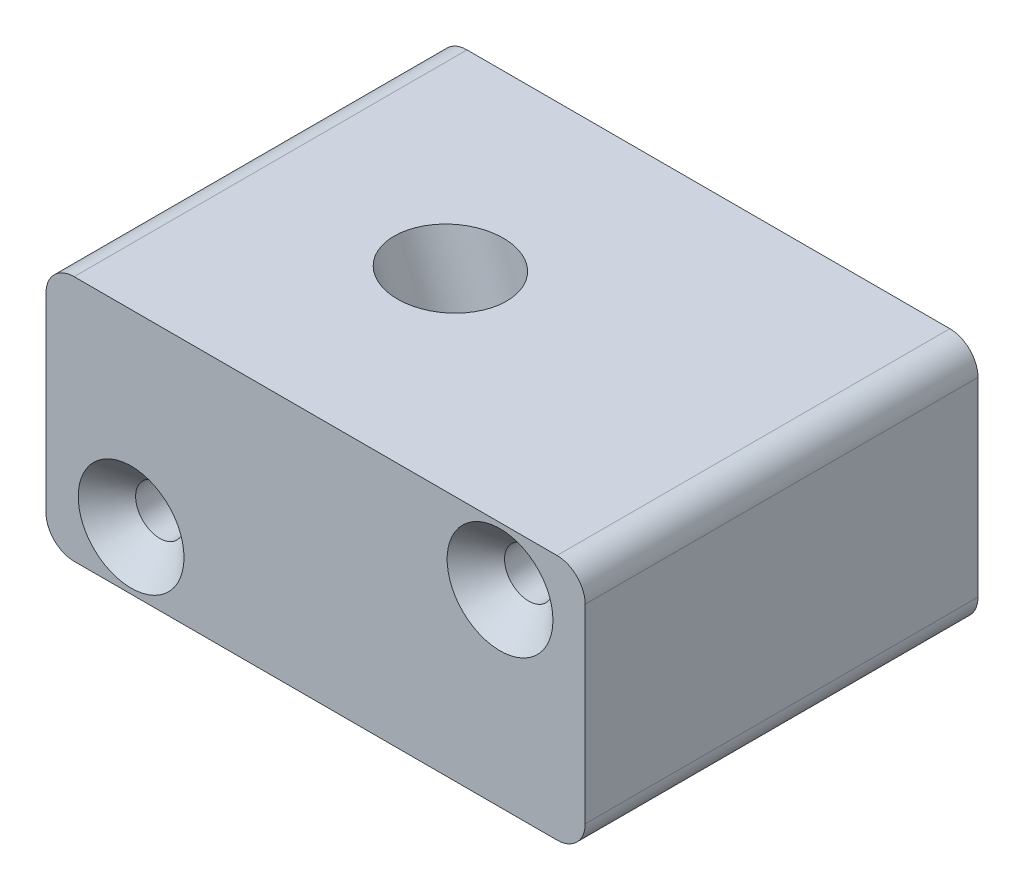
ISO-10303-21;
HEADER;
FILE_DESCRIPTION(('STEP AP214'),'2;1');
FILE_NAME('part.step','',(''),(''),'','','');
FILE_SCHEMA(('AUTOMOTIVE_DESIGN { 1 0 10303 214 1 1 1 1 }'));
ENDSEC;
DATA;
#1=APPLICATION_CONTEXT('core data for automotive mechanical design processes');
#2=APPLICATION_PROTOCOL_DEFINITION('international standard','automotive_design',2000,#1);
#3=PRODUCT_CONTEXT('',#1,'mechanical');
#4=PRODUCT('Part','Part','',(#3));
#5=PRODUCT_RELATED_PRODUCT_CATEGORY('part','',(#4));
#6=PRODUCT_DEFINITION_FORMATION('','',#4);
#7=PRODUCT_DEFINITION_CONTEXT('part definition',#1,'design');
#8=PRODUCT_DEFINITION('design','',#6,#7);
#9=PRODUCT_DEFINITION_SHAPE('','',#8);
#10=(LENGTH_UNIT() NAMED_UNIT(*) SI_UNIT(.MILLI.,.METRE.));
#11=(NAMED_UNIT(*) PLANE_ANGLE_UNIT() SI_UNIT($,.RADIAN.));
#12=(NAMED_UNIT(*) SI_UNIT($,.STERADIAN.) SOLID_ANGLE_UNIT());
#13=UNCERTAINTY_MEASURE_WITH_UNIT(LENGTH_MEASURE(1.E-05),#10,'distance_accuracy_value','');
#14=(GEOMETRIC_REPRESENTATION_CONTEXT(3) GLOBAL_UNCERTAINTY_ASSIGNED_CONTEXT((#13)) GLOBAL_UNIT_ASSIGNED_CONTEXT((#10,
#11,#12)) REPRESENTATION_CONTEXT('',''));
#15=CARTESIAN_POINT('',(0.,0.,0.));
#16=DIRECTION('',(0.,0.,1.));
#17=DIRECTION('',(1.,0.,0.));
#18=AXIS2_PLACEMENT_3D('',#15,#16,#17);
#19=CARTESIAN_POINT('',(-21.45,-8.45,17.45));
#20=DIRECTION('',(0.,0.,-1.));
#21=DIRECTION('',(-1.,0.,0.));
#22=AXIS2_PLACEMENT_3D('',#19,#20,#21);
#23=CYLINDRICAL_SURFACE('',#22,2.5);
#24=CARTESIAN_POINT('',(-21.45,-8.45,-17.45));
#25=DIRECTION('',(0.,0.,1.));
#26=DIRECTION('',(1.,0.,0.));
#27=AXIS2_PLACEMENT_3D('',#24,#25,#26);
#28=CIRCLE('',#27,2.5);
#29=CARTESIAN_POINT('',(-23.95,-8.45,-17.45));
#30=VERTEX_POINT('',#29);
#31=CARTESIAN_POINT('',(-21.45,-10.95,-17.45));
#32=VERTEX_POINT('',#31);
#33=EDGE_CURVE('E138',#30,#32,#28,.T.);
#34=ORIENTED_EDGE('',*,*,#33,.T.);
#35=DIRECTION('',(0.,0.,-1.));
#36=VECTOR('',#35,1.);
#37=CARTESIAN_POINT('',(-21.45,-10.95,17.45));
#38=LINE('',#37,#36);
#39=CARTESIAN_POINT('',(-21.45,-10.95,17.45));
#40=VERTEX_POINT('',#39);
#41=EDGE_CURVE('E11',#40,#32,#38,.T.);
#42=ORIENTED_EDGE('',*,*,#41,.F.);
#43=CARTESIAN_POINT('',(-21.45,-8.45,17.45));
#44=DIRECTION('',(0.,0.,1.));
#45=DIRECTION('',(1.,0.,0.));
#46=AXIS2_PLACEMENT_3D('',#43,#44,#45);
#47=CIRCLE('',#46,2.5);
#48=CARTESIAN_POINT('',(-23.95,-8.45,17.45));
#49=VERTEX_POINT('',#48);
#50=EDGE_CURVE('E153',#49,#40,#47,.T.);
#51=ORIENTED_EDGE('',*,*,#50,.F.);
#52=DIRECTION('',(0.,0.,-1.));
#53=VECTOR('',#52,1.);
#54=CARTESIAN_POINT('',(-23.95,-8.45,17.45));
#55=LINE('',#54,#53);
#56=EDGE_CURVE('E134',#49,#30,#55,.T.);
#57=ORIENTED_EDGE('',*,*,#56,.T.);
#58=EDGE_LOOP('',(#34,#42,#51,#57));
#59=FACE_BOUND('',#58,.T.);
#60=ADVANCED_FACE('F41',(#59),#23,.T.);
#61=CARTESIAN_POINT('',(-21.45,-10.95,17.45));
#62=DIRECTION('',(0.,1.,0.));
#63=DIRECTION('',(0.,0.,1.));
#64=AXIS2_PLACEMENT_3D('',#61,#62,#63);
#65=PLANE('',#64);
#66=CARTESIAN_POINT('',(2.61261002162697,-10.95,0.114999999999997));
#67=DIRECTION('',(0.,1.,0.));
#68=DIRECTION('',(-1.,0.,0.));
#69=AXIS2_PLACEMENT_3D('',#66,#67,#68);
#70=ELLIPSE('',#69,5.00057135286431,4.699);
#71=CARTESIAN_POINT('',(-2.38796133123734,-10.95,0.114999999999998));
#72=VERTEX_POINT('',#71);
#73=EDGE_CURVE('E204',#72,#72,#70,.F.);
#74=ORIENTED_EDGE('',*,*,#73,.F.);
#75=EDGE_LOOP('',(#74));
#76=FACE_BOUND('',#75,.T.);
#77=DIRECTION('',(1.,0.,0.));
#78=VECTOR('',#77,1.);
#79=CARTESIAN_POINT('',(-21.45,-10.95,-17.45));
#80=LINE('',#79,#78);
#81=CARTESIAN_POINT('',(21.45,-10.95,-17.45));
#82=VERTEX_POINT('',#81);
#83=EDGE_CURVE('E141',#32,#82,#80,.T.);
#84=ORIENTED_EDGE('',*,*,#83,.T.);
#85=DIRECTION('',(0.,0.,-1.));
#86=VECTOR('',#85,1.);
#87=CARTESIAN_POINT('',(21.45,-10.95,17.45));
#88=LINE('',#87,#86);
#89=CARTESIAN_POINT('',(21.45,-10.95,17.45));
#90=VERTEX_POINT('',#89);
#91=EDGE_CURVE('E50',#90,#82,#88,.T.);
#92=ORIENTED_EDGE('',*,*,#91,.F.);
#93=DIRECTION('',(1.,0.,0.));
#94=VECTOR('',#93,1.);
#95=CARTESIAN_POINT('',(-21.45,-10.95,17.45));
#96=LINE('',#95,#94);
#97=EDGE_CURVE('E101',#40,#90,#96,.T.);
#98=ORIENTED_EDGE('',*,*,#97,.F.);
#99=ORIENTED_EDGE('',*,*,#41,.T.);
#100=EDGE_LOOP('',(#84,#92,#98,#99));
#101=FACE_BOUND('',#100,.T.);
#102=ADVANCED_FACE('F225',(#76,#101),#65,.F.);
#103=CARTESIAN_POINT('',(21.45,-8.45,17.45));
#104=DIRECTION('',(0.,0.,-1.));
#105=DIRECTION('',(-1.,0.,0.));
#106=AXIS2_PLACEMENT_3D('',#103,#104,#105);
#107=CYLINDRICAL_SURFACE('',#106,2.5);
#108=CARTESIAN_POINT('',(21.45,-8.45,-17.45));
#109=DIRECTION('',(0.,0.,1.));
#110=DIRECTION('',(1.,0.,0.));
#111=AXIS2_PLACEMENT_3D('',#108,#109,#110);
#112=CIRCLE('',#111,2.5);
#113=CARTESIAN_POINT('',(23.95,-8.45,-17.45));
#114=VERTEX_POINT('',#113);
#115=EDGE_CURVE('E144',#82,#114,#112,.T.);
#116=ORIENTED_EDGE('',*,*,#115,.T.);
#117=DIRECTION('',(0.,0.,-1.));
#118=VECTOR('',#117,1.);
#119=CARTESIAN_POINT('',(23.95,-8.45,17.45));
#120=LINE('',#119,#118);
#121=CARTESIAN_POINT('',(23.95,-8.45,17.45));
#122=VERTEX_POINT('',#121);
#123=EDGE_CURVE('E160',#122,#114,#120,.T.);
#124=ORIENTED_EDGE('',*,*,#123,.F.);
#125=CARTESIAN_POINT('',(21.45,-8.45,17.45));
#126=DIRECTION('',(0.,0.,1.));
#127=DIRECTION('',(1.,0.,0.));
#128=AXIS2_PLACEMENT_3D('',#125,#126,#127);
#129=CIRCLE('',#128,2.5);
#130=EDGE_CURVE('E169',#90,#122,#129,.T.);
#131=ORIENTED_EDGE('',*,*,#130,.F.);
#132=ORIENTED_EDGE('',*,*,#91,.T.);
#133=EDGE_LOOP('',(#116,#124,#131,#132));
#134=FACE_BOUND('',#133,.T.);
#135=ADVANCED_FACE('F167',(#134),#107,.T.);
#136=CARTESIAN_POINT('',(23.95,-8.45,17.45));
#137=DIRECTION('',(-1.,0.,0.));
#138=DIRECTION('',(0.,0.,1.));
#139=AXIS2_PLACEMENT_3D('',#136,#137,#138);
#140=PLANE('',#139);
#141=DIRECTION('',(0.,1.,0.));
#142=VECTOR('',#141,1.);
#143=CARTESIAN_POINT('',(23.95,-8.45,-17.45));
#144=LINE('',#143,#142);
#145=CARTESIAN_POINT('',(23.95,8.45,-17.45));
#146=VERTEX_POINT('',#145);
#147=EDGE_CURVE('E146',#114,#146,#144,.T.);
#148=ORIENTED_EDGE('',*,*,#147,.T.);
#149=DIRECTION('',(0.,0.,-1.));
#150=VECTOR('',#149,1.);
#151=CARTESIAN_POINT('',(23.95,8.45,17.45));
#152=LINE('',#151,#150);
#153=CARTESIAN_POINT('',(23.95,8.45,17.45));
#154=VERTEX_POINT('',#153);
#155=EDGE_CURVE('E157',#154,#146,#152,.T.);
#156=ORIENTED_EDGE('',*,*,#155,.F.);
#157=DIRECTION('',(0.,1.,0.));
#158=VECTOR('',#157,1.);
#159=CARTESIAN_POINT('',(23.95,-8.45,17.45));
#160=LINE('',#159,#158);
#161=EDGE_CURVE('E181',#122,#154,#160,.T.);
#162=ORIENTED_EDGE('',*,*,#161,.F.);
#163=ORIENTED_EDGE('',*,*,#123,.T.);
#164=EDGE_LOOP('',(#148,#156,#162,#163));
#165=FACE_BOUND('',#164,.T.);
#166=ADVANCED_FACE('F177',(#165),#140,.F.);
#167=CARTESIAN_POINT('',(21.45,8.45,17.45));
#168=DIRECTION('',(0.,0.,-1.));
#169=DIRECTION('',(-1.,0.,0.));
#170=AXIS2_PLACEMENT_3D('',#167,#168,#169);
#171=CYLINDRICAL_SURFACE('',#170,2.5);
#172=CARTESIAN_POINT('',(21.45,8.45,-17.45));
#173=DIRECTION('',(0.,0.,1.));
#174=DIRECTION('',(1.,0.,0.));
#175=AXIS2_PLACEMENT_3D('',#172,#173,#174);
#176=CIRCLE('',#175,2.5);
#177=CARTESIAN_POINT('',(21.45,10.95,-17.45));
#178=VERTEX_POINT('',#177);
#179=EDGE_CURVE('E148',#146,#178,#176,.T.);
#180=ORIENTED_EDGE('',*,*,#179,.T.);
#181=DIRECTION('',(0.,0.,-1.));
#182=VECTOR('',#181,1.);
#183=CARTESIAN_POINT('',(21.45,10.95,17.45));
#184=LINE('',#183,#182);
#185=CARTESIAN_POINT('',(21.45,10.95,17.45));
#186=VERTEX_POINT('',#185);
#187=EDGE_CURVE('E129',#186,#178,#184,.T.);
#188=ORIENTED_EDGE('',*,*,#187,.F.);
#189=CARTESIAN_POINT('',(21.45,8.45,17.45));
#190=DIRECTION('',(0.,0.,1.));
#191=DIRECTION('',(1.,0.,0.));
#192=AXIS2_PLACEMENT_3D('',#189,#190,#191);
#193=CIRCLE('',#192,2.5);
#194=EDGE_CURVE('E120',#154,#186,#193,.T.);
#195=ORIENTED_EDGE('',*,*,#194,.F.);
#196=ORIENTED_EDGE('',*,*,#155,.T.);
#197=EDGE_LOOP('',(#180,#188,#195,#196));
#198=FACE_BOUND('',#197,.T.);
#199=ADVANCED_FACE('F180',(#198),#171,.T.);
#200=CARTESIAN_POINT('',(-21.45,10.95,17.45));
#201=DIRECTION('',(0.,-1.,0.));
#202=DIRECTION('',(0.,0.,-1.));
#203=AXIS2_PLACEMENT_3D('',#200,#201,#202);
#204=PLANE('',#203);
#205=CARTESIAN_POINT('',(-5.35833810880288,10.95,0.115));
#206=DIRECTION('',(0.,-1.,0.));
#207=DIRECTION('',(-1.,0.,0.));
#208=AXIS2_PLACEMENT_3D('',#205,#206,#207);
#209=ELLIPSE('',#208,5.00057135286431,4.699);
#210=CARTESIAN_POINT('',(-10.3589094616672,10.95,0.115000000000001));
#211=VERTEX_POINT('',#210);
#212=EDGE_CURVE('E44',#211,#211,#209,.F.);
#213=ORIENTED_EDGE('',*,*,#212,.F.);
#214=EDGE_LOOP('',(#213));
#215=FACE_BOUND('',#214,.T.);
#216=DIRECTION('',(-1.,0.,0.));
#217=VECTOR('',#216,1.);
#218=CARTESIAN_POINT('',(-21.45,10.95,-17.45));
#219=LINE('',#218,#217);
#220=CARTESIAN_POINT('',(-21.45,10.95,-17.45));
#221=VERTEX_POINT('',#220);
#222=EDGE_CURVE('E128',#178,#221,#219,.T.);
#223=ORIENTED_EDGE('',*,*,#222,.T.);
#224=DIRECTION('',(0.,0.,-1.));
#225=VECTOR('',#224,1.);
#226=CARTESIAN_POINT('',(-21.45,10.95,17.45));
#227=LINE('',#226,#225);
#228=CARTESIAN_POINT('',(-21.45,10.95,17.45));
#229=VERTEX_POINT('',#228);
#230=EDGE_CURVE('E125',#229,#221,#227,.T.);
#231=ORIENTED_EDGE('',*,*,#230,.F.);
#232=DIRECTION('',(-1.,0.,0.));
#233=VECTOR('',#232,1.);
#234=CARTESIAN_POINT('',(-21.45,10.95,17.45));
#235=LINE('',#234,#233);
#236=EDGE_CURVE('E114',#186,#229,#235,.T.);
#237=ORIENTED_EDGE('',*,*,#236,.F.);
#238=ORIENTED_EDGE('',*,*,#187,.T.);
#239=EDGE_LOOP('',(#223,#231,#237,#238));
#240=FACE_BOUND('',#239,.T.);
#241=ADVANCED_FACE('F126',(#215,#240),#204,.F.);
#242=CARTESIAN_POINT('',(-21.45,8.45,17.45));
#243=DIRECTION('',(0.,0.,-1.));
#244=DIRECTION('',(-1.,0.,0.));
#245=AXIS2_PLACEMENT_3D('',#242,#243,#244);
#246=CYLINDRICAL_SURFACE('',#245,2.5);
#247=CARTESIAN_POINT('',(-21.45,8.45,-17.45));
#248=DIRECTION('',(0.,0.,1.));
#249=DIRECTION('',(1.,0.,0.));
#250=AXIS2_PLACEMENT_3D('',#247,#248,#249);
#251=CIRCLE('',#250,2.5);
#252=CARTESIAN_POINT('',(-23.95,8.45,-17.45));
#253=VERTEX_POINT('',#252);
#254=EDGE_CURVE('E87',#221,#253,#251,.T.);
#255=ORIENTED_EDGE('',*,*,#254,.T.);
#256=DIRECTION('',(0.,0.,-1.));
#257=VECTOR('',#256,1.);
#258=CARTESIAN_POINT('',(-23.95,8.45,17.45));
#259=LINE('',#258,#257);
#260=CARTESIAN_POINT('',(-23.95,8.45,17.45));
#261=VERTEX_POINT('',#260);
#262=EDGE_CURVE('E130',#261,#253,#259,.T.);
#263=ORIENTED_EDGE('',*,*,#262,.F.);
#264=CARTESIAN_POINT('',(-21.45,8.45,17.45));
#265=DIRECTION('',(0.,0.,1.));
#266=DIRECTION('',(1.,0.,0.));
#267=AXIS2_PLACEMENT_3D('',#264,#265,#266);
#268=CIRCLE('',#267,2.5);
#269=EDGE_CURVE('E118',#229,#261,#268,.T.);
#270=ORIENTED_EDGE('',*,*,#269,.F.);
#271=ORIENTED_EDGE('',*,*,#230,.T.);
#272=EDGE_LOOP('',(#255,#263,#270,#271));
#273=FACE_BOUND('',#272,.T.);
#274=ADVANCED_FACE('F132',(#273),#246,.T.);
#275=CARTESIAN_POINT('',(-23.95,-8.45,17.45));
#276=DIRECTION('',(1.,0.,0.));
#277=DIRECTION('',(0.,0.,-1.));
#278=AXIS2_PLACEMENT_3D('',#275,#276,#277);
#279=PLANE('',#278);
#280=DIRECTION('',(0.,-1.,0.));
#281=VECTOR('',#280,1.);
#282=CARTESIAN_POINT('',(-23.95,-8.45,-17.45));
#283=LINE('',#282,#281);
#284=EDGE_CURVE('E93',#253,#30,#283,.T.);
#285=ORIENTED_EDGE('',*,*,#284,.T.);
#286=ORIENTED_EDGE('',*,*,#56,.F.);
#287=DIRECTION('',(0.,-1.,0.));
#288=VECTOR('',#287,1.);
#289=CARTESIAN_POINT('',(-23.95,-8.45,17.45));
#290=LINE('',#289,#288);
#291=EDGE_CURVE('E58',#261,#49,#290,.T.);
#292=ORIENTED_EDGE('',*,*,#291,.F.);
#293=ORIENTED_EDGE('',*,*,#262,.T.);
#294=EDGE_LOOP('',(#285,#286,#292,#293));
#295=FACE_BOUND('',#294,.T.);
#296=ADVANCED_FACE('F220',(#295),#279,.F.);
#297=CARTESIAN_POINT('',(-21.45,-8.45,17.45));
#298=DIRECTION('',(0.,0.,1.));
#299=DIRECTION('',(1.,0.,0.));
#300=AXIS2_PLACEMENT_3D('',#297,#298,#299);
#301=PLANE('',#300);
#302=CARTESIAN_POINT('',(-16.388274302445,-5.78208425284593,17.45));
#303=DIRECTION('',(0.,0.,1.));
#304=DIRECTION('',(1.,0.,0.));
#305=AXIS2_PLACEMENT_3D('',#302,#303,#304);
#306=CIRCLE('',#305,4.7);
#307=CARTESIAN_POINT('',(-11.688274302445,-5.78208425284593,17.45));
#308=VERTEX_POINT('',#307);
#309=EDGE_CURVE('E201',#308,#308,#306,.T.);
#310=ORIENTED_EDGE('',*,*,#309,.F.);
#311=EDGE_LOOP('',(#310));
#312=FACE_BOUND('',#311,.T.);
#313=CARTESIAN_POINT('',(16.388274302445,5.78208425284594,17.45));
#314=DIRECTION('',(0.,0.,1.));
#315=DIRECTION('',(1.,0.,0.));
#316=AXIS2_PLACEMENT_3D('',#313,#314,#315);
#317=CIRCLE('',#316,4.7);
#318=CARTESIAN_POINT('',(21.088274302445,5.78208425284594,17.45));
#319=VERTEX_POINT('',#318);
#320=EDGE_CURVE('E192',#319,#319,#317,.T.);
#321=ORIENTED_EDGE('',*,*,#320,.F.);
#322=EDGE_LOOP('',(#321));
#323=FACE_BOUND('',#322,.T.);
#324=ORIENTED_EDGE('',*,*,#50,.T.);
#325=ORIENTED_EDGE('',*,*,#97,.T.);
#326=ORIENTED_EDGE('',*,*,#130,.T.);
#327=ORIENTED_EDGE('',*,*,#161,.T.);
#328=ORIENTED_EDGE('',*,*,#194,.T.);
#329=ORIENTED_EDGE('',*,*,#236,.T.);
#330=ORIENTED_EDGE('',*,*,#269,.T.);
#331=ORIENTED_EDGE('',*,*,#291,.T.);
#332=EDGE_LOOP('',(#324,#325,#326,#327,#328,#329,#330,#331));
#333=FACE_BOUND('',#332,.T.);
#334=ADVANCED_FACE('F116',(#312,#323,#333),#301,.T.);
#335=CARTESIAN_POINT('',(-21.45,-8.45,-17.45));
#336=DIRECTION('',(0.,0.,1.));
#337=DIRECTION('',(1.,0.,0.));
#338=AXIS2_PLACEMENT_3D('',#335,#336,#337);
#339=PLANE('',#338);
#340=CARTESIAN_POINT('',(-16.388274302445,-5.78208425284593,-17.45));
#341=DIRECTION('',(0.,0.,1.));
#342=DIRECTION('',(1.,0.,0.));
#343=AXIS2_PLACEMENT_3D('',#340,#341,#342);
#344=CIRCLE('',#343,2.14999999999999);
#345=CARTESIAN_POINT('',(-14.238274302445,-5.78208425284593,-17.45));
#346=VERTEX_POINT('',#345);
#347=EDGE_CURVE('E195',#346,#346,#344,.T.);
#348=ORIENTED_EDGE('',*,*,#347,.T.);
#349=EDGE_LOOP('',(#348));
#350=FACE_BOUND('',#349,.T.);
#351=CARTESIAN_POINT('',(16.388274302445,5.78208425284594,-17.45));
#352=DIRECTION('',(0.,0.,1.));
#353=DIRECTION('',(1.,0.,0.));
#354=AXIS2_PLACEMENT_3D('',#351,#352,#353);
#355=CIRCLE('',#354,2.14999999999999);
#356=CARTESIAN_POINT('',(18.538274302445,5.78208425284594,-17.45));
#357=VERTEX_POINT('',#356);
#358=EDGE_CURVE('E142',#357,#357,#355,.T.);
#359=ORIENTED_EDGE('',*,*,#358,.T.);
#360=EDGE_LOOP('',(#359));
#361=FACE_BOUND('',#360,.T.);
#362=ORIENTED_EDGE('',*,*,#33,.F.);
#363=ORIENTED_EDGE('',*,*,#284,.F.);
#364=ORIENTED_EDGE('',*,*,#254,.F.);
#365=ORIENTED_EDGE('',*,*,#222,.F.);
#366=ORIENTED_EDGE('',*,*,#179,.F.);
#367=ORIENTED_EDGE('',*,*,#147,.F.);
#368=ORIENTED_EDGE('',*,*,#115,.F.);
#369=ORIENTED_EDGE('',*,*,#83,.F.);
#370=EDGE_LOOP('',(#362,#363,#364,#365,#366,#367,#368,#369));
#371=FACE_BOUND('',#370,.T.);
#372=ADVANCED_FACE('F173',(#350,#361,#371),#339,.F.);
#373=CARTESIAN_POINT('',(16.388274302445,5.78208425284594,17.45));
#374=DIRECTION('',(0.,0.,1.));
#375=DIRECTION('',(1.,0.,0.));
#376=AXIS2_PLACEMENT_3D('',#373,#374,#375);
#377=CYLINDRICAL_SURFACE('',#376,2.14999999999999);
#378=ORIENTED_EDGE('',*,*,#358,.F.);
#379=EDGE_LOOP('',(#378));
#380=FACE_BOUND('',#379,.T.);
#381=CARTESIAN_POINT('',(16.388274302445,5.78208425284594,14.9));
#382=DIRECTION('',(0.,0.,1.));
#383=DIRECTION('',(1.,0.,0.));
#384=AXIS2_PLACEMENT_3D('',#381,#382,#383);
#385=CIRCLE('',#384,2.15);
#386=CARTESIAN_POINT('',(18.538274302445,5.78208425284594,14.9));
#387=VERTEX_POINT('',#386);
#388=EDGE_CURVE('E189',#387,#387,#385,.T.);
#389=ORIENTED_EDGE('',*,*,#388,.T.);
#390=EDGE_LOOP('',(#389));
#391=FACE_BOUND('',#390,.T.);
#392=ADVANCED_FACE('F242',(#380,#391),#377,.F.);
#393=CARTESIAN_POINT('',(16.388274302445,5.78208425284594,17.45));
#394=DIRECTION('',(0.,0.,1.));
#395=DIRECTION('',(1.,0.,0.));
#396=AXIS2_PLACEMENT_3D('',#393,#394,#395);
#397=CONICAL_SURFACE('',#396,4.7,0.785398163397448);
#398=ORIENTED_EDGE('',*,*,#388,.F.);
#399=EDGE_LOOP('',(#398));
#400=FACE_BOUND('',#399,.T.);
#401=ORIENTED_EDGE('',*,*,#320,.T.);
#402=EDGE_LOOP('',(#401));
#403=FACE_BOUND('',#402,.T.);
#404=ADVANCED_FACE('F247',(#400,#403),#397,.F.);
#405=CARTESIAN_POINT('',(-16.388274302445,-5.78208425284593,17.45));
#406=DIRECTION('',(0.,0.,1.));
#407=DIRECTION('',(1.,0.,0.));
#408=AXIS2_PLACEMENT_3D('',#405,#406,#407);
#409=CYLINDRICAL_SURFACE('',#408,2.14999999999999);
#410=ORIENTED_EDGE('',*,*,#347,.F.);
#411=EDGE_LOOP('',(#410));
#412=FACE_BOUND('',#411,.T.);
#413=CARTESIAN_POINT('',(-16.388274302445,-5.78208425284593,14.9));
#414=DIRECTION('',(0.,0.,1.));
#415=DIRECTION('',(1.,0.,0.));
#416=AXIS2_PLACEMENT_3D('',#413,#414,#415);
#417=CIRCLE('',#416,2.15);
#418=CARTESIAN_POINT('',(-14.238274302445,-5.78208425284593,14.9));
#419=VERTEX_POINT('',#418);
#420=EDGE_CURVE('E198',#419,#419,#417,.T.);
#421=ORIENTED_EDGE('',*,*,#420,.T.);
#422=EDGE_LOOP('',(#421));
#423=FACE_BOUND('',#422,.T.);
#424=ADVANCED_FACE('F251',(#412,#423),#409,.F.);
#425=CARTESIAN_POINT('',(-16.388274302445,-5.78208425284593,17.45));
#426=DIRECTION('',(0.,0.,1.));
#427=DIRECTION('',(1.,0.,0.));
#428=AXIS2_PLACEMENT_3D('',#425,#426,#427);
#429=CONICAL_SURFACE('',#428,4.7,0.785398163397448);
#430=ORIENTED_EDGE('',*,*,#420,.F.);
#431=EDGE_LOOP('',(#430));
#432=FACE_BOUND('',#431,.T.);
#433=ORIENTED_EDGE('',*,*,#309,.T.);
#434=EDGE_LOOP('',(#433));
#435=FACE_BOUND('',#434,.T.);
#436=ADVANCED_FACE('F255',(#432,#435),#429,.F.);
#437=CARTESIAN_POINT('',(-7.90056186073679,17.9347023536396,0.115000000000001));
#438=DIRECTION('',(-0.342020143325669,0.939692620785908,0.));
#439=DIRECTION('',(-0.939692620785908,-0.342020143325669,0.));
#440=AXIS2_PLACEMENT_3D('',#437,#438,#439);
#441=CYLINDRICAL_SURFACE('',#440,4.699);
#442=ORIENTED_EDGE('',*,*,#212,.T.);
#443=EDGE_LOOP('',(#442));
#444=FACE_BOUND('',#443,.T.);
#445=ORIENTED_EDGE('',*,*,#73,.T.);
#446=EDGE_LOOP('',(#445));
#447=FACE_BOUND('',#446,.T.);
#448=ADVANCED_FACE('F211',(#444,#447),#441,.F.);
#449=CLOSED_SHELL('',(#60,#102,#135,#166,#199,#241,#274,#296,#334,#372,#392,#404,#424,#436,#448));
#450=MANIFOLD_SOLID_BREP('B2',#449);
#451=ADVANCED_BREP_SHAPE_REPRESENTATION('',(#18,#450),#14);
#452=SHAPE_DEFINITION_REPRESENTATION(#9,#451);
ENDSEC;
END-ISO-10303-21;
